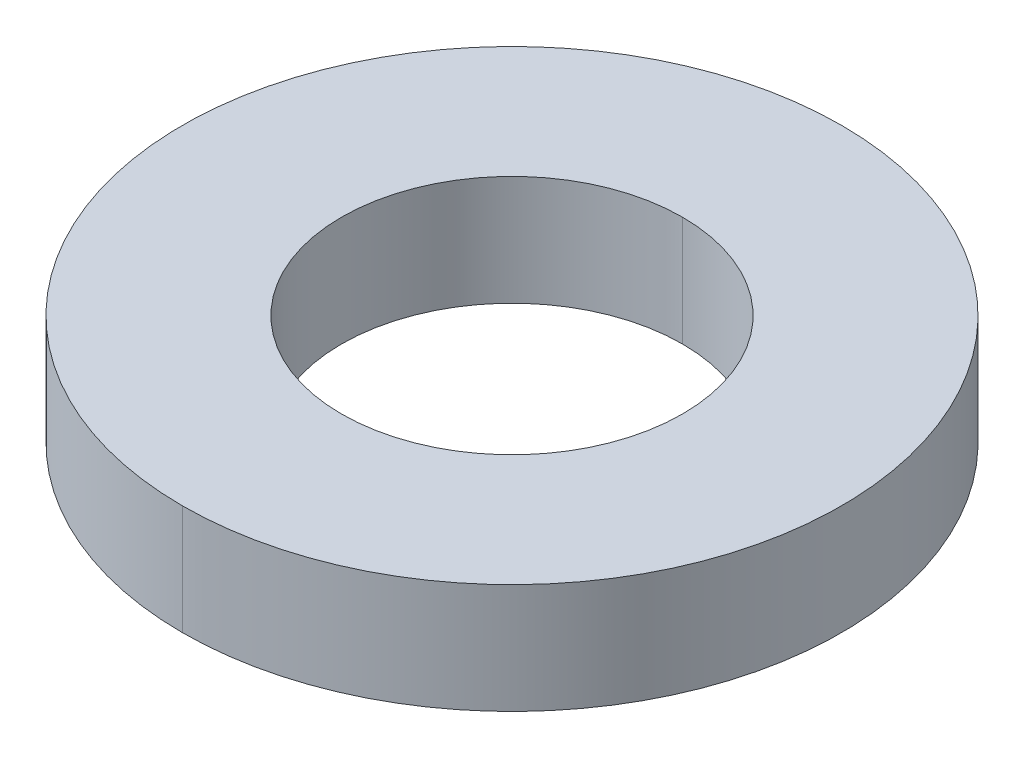
ISO-10303-21;
HEADER;
FILE_DESCRIPTION(('STEP AP214'),'2;1');
FILE_NAME('part.step','',(''),(''),'','','');
FILE_SCHEMA(('AUTOMOTIVE_DESIGN { 1 0 10303 214 1 1 1 1 }'));
ENDSEC;
DATA;
#1=APPLICATION_CONTEXT('core data for automotive mechanical design processes');
#2=APPLICATION_PROTOCOL_DEFINITION('international standard','automotive_design',2000,#1);
#3=PRODUCT_CONTEXT('',#1,'mechanical');
#4=PRODUCT('Part','Part','',(#3));
#5=PRODUCT_RELATED_PRODUCT_CATEGORY('part','',(#4));
#6=PRODUCT_DEFINITION_FORMATION('','',#4);
#7=PRODUCT_DEFINITION_CONTEXT('part definition',#1,'design');
#8=PRODUCT_DEFINITION('design','',#6,#7);
#9=PRODUCT_DEFINITION_SHAPE('','',#8);
#10=(LENGTH_UNIT() NAMED_UNIT(*) SI_UNIT(.MILLI.,.METRE.));
#11=(NAMED_UNIT(*) PLANE_ANGLE_UNIT() SI_UNIT($,.RADIAN.));
#12=(NAMED_UNIT(*) SI_UNIT($,.STERADIAN.) SOLID_ANGLE_UNIT());
#13=UNCERTAINTY_MEASURE_WITH_UNIT(LENGTH_MEASURE(1.E-05),#10,'distance_accuracy_value','');
#14=(GEOMETRIC_REPRESENTATION_CONTEXT(3) GLOBAL_UNCERTAINTY_ASSIGNED_CONTEXT((#13)) GLOBAL_UNIT_ASSIGNED_CONTEXT((#10,
#11,#12)) REPRESENTATION_CONTEXT('',''));
#15=CARTESIAN_POINT('',(0.,0.,0.));
#16=DIRECTION('',(0.,0.,1.));
#17=DIRECTION('',(1.,0.,0.));
#18=AXIS2_PLACEMENT_3D('',#15,#16,#17);
#19=CARTESIAN_POINT('',(0.,1.5875,0.));
#20=DIRECTION('',(0.,-1.,0.));
#21=DIRECTION('',(0.,0.,-1.));
#22=AXIS2_PLACEMENT_3D('',#19,#20,#21);
#23=CYLINDRICAL_SURFACE('',#22,2.4638);
#24=DIRECTION('',(0.,-1.,0.));
#25=VECTOR('',#24,1.);
#26=CARTESIAN_POINT('',(0.,1.5875,2.4638));
#27=LINE('',#26,#25);
#28=CARTESIAN_POINT('',(0.,1.5875,2.4638));
#29=VERTEX_POINT('',#28);
#30=CARTESIAN_POINT('',(0.,0.,2.4638));
#31=VERTEX_POINT('',#30);
#32=EDGE_CURVE('E77',#29,#31,#27,.T.);
#33=ORIENTED_EDGE('',*,*,#32,.F.);
#34=CARTESIAN_POINT('',(0.,1.5875,0.));
#35=DIRECTION('',(0.,1.,0.));
#36=DIRECTION('',(0.,0.,1.));
#37=AXIS2_PLACEMENT_3D('',#34,#35,#36);
#38=CIRCLE('',#37,2.4638);
#39=CARTESIAN_POINT('',(0.,1.5875,-2.4638));
#40=VERTEX_POINT('',#39);
#41=EDGE_CURVE('E20',#29,#40,#38,.T.);
#42=ORIENTED_EDGE('',*,*,#41,.T.);
#43=DIRECTION('',(0.,-1.,0.));
#44=VECTOR('',#43,1.);
#45=CARTESIAN_POINT('',(0.,1.5875,-2.4638));
#46=LINE('',#45,#44);
#47=CARTESIAN_POINT('',(0.,0.,-2.4638));
#48=VERTEX_POINT('',#47);
#49=EDGE_CURVE('E74',#40,#48,#46,.T.);
#50=ORIENTED_EDGE('',*,*,#49,.T.);
#51=CARTESIAN_POINT('',(0.,0.,0.));
#52=DIRECTION('',(0.,1.,0.));
#53=DIRECTION('',(0.,0.,1.));
#54=AXIS2_PLACEMENT_3D('',#51,#52,#53);
#55=CIRCLE('',#54,2.4638);
#56=EDGE_CURVE('E11',#31,#48,#55,.T.);
#57=ORIENTED_EDGE('',*,*,#56,.F.);
#58=EDGE_LOOP('',(#33,#42,#50,#57));
#59=FACE_BOUND('',#58,.T.);
#60=ADVANCED_FACE('F17',(#59),#23,.F.);
#61=CARTESIAN_POINT('',(0.,1.5875,0.));
#62=DIRECTION('',(0.,-1.,0.));
#63=DIRECTION('',(0.,0.,-1.));
#64=AXIS2_PLACEMENT_3D('',#61,#62,#63);
#65=CYLINDRICAL_SURFACE('',#64,4.7625);
#66=DIRECTION('',(0.,-1.,0.));
#67=VECTOR('',#66,1.);
#68=CARTESIAN_POINT('',(0.,1.5875,4.7625));
#69=LINE('',#68,#67);
#70=CARTESIAN_POINT('',(0.,1.5875,4.7625));
#71=VERTEX_POINT('',#70);
#72=CARTESIAN_POINT('',(0.,0.,4.7625));
#73=VERTEX_POINT('',#72);
#74=EDGE_CURVE('E111',#71,#73,#69,.T.);
#75=ORIENTED_EDGE('',*,*,#74,.F.);
#76=CARTESIAN_POINT('',(0.,1.5875,0.));
#77=DIRECTION('',(0.,1.,0.));
#78=DIRECTION('',(0.,0.,1.));
#79=AXIS2_PLACEMENT_3D('',#76,#77,#78);
#80=CIRCLE('',#79,4.7625);
#81=CARTESIAN_POINT('',(0.,1.5875,-4.7625));
#82=VERTEX_POINT('',#81);
#83=EDGE_CURVE('E82',#82,#71,#80,.T.);
#84=ORIENTED_EDGE('',*,*,#83,.F.);
#85=DIRECTION('',(0.,-1.,0.));
#86=VECTOR('',#85,1.);
#87=CARTESIAN_POINT('',(0.,1.5875,-4.7625));
#88=LINE('',#87,#86);
#89=CARTESIAN_POINT('',(0.,0.,-4.7625));
#90=VERTEX_POINT('',#89);
#91=EDGE_CURVE('E106',#82,#90,#88,.T.);
#92=ORIENTED_EDGE('',*,*,#91,.T.);
#93=CARTESIAN_POINT('',(0.,0.,0.));
#94=DIRECTION('',(0.,1.,0.));
#95=DIRECTION('',(0.,0.,1.));
#96=AXIS2_PLACEMENT_3D('',#93,#94,#95);
#97=CIRCLE('',#96,4.7625);
#98=EDGE_CURVE('E26',#90,#73,#97,.T.);
#99=ORIENTED_EDGE('',*,*,#98,.T.);
#100=EDGE_LOOP('',(#75,#84,#92,#99));
#101=FACE_BOUND('',#100,.T.);
#102=ADVANCED_FACE('F122',(#101),#65,.T.);
#103=CARTESIAN_POINT('',(0.,0.,0.));
#104=DIRECTION('',(0.,1.,0.));
#105=DIRECTION('',(1.,0.,0.));
#106=AXIS2_PLACEMENT_3D('',#103,#104,#105);
#107=PLANE('',#106);
#108=CARTESIAN_POINT('',(0.,0.,0.));
#109=DIRECTION('',(0.,1.,0.));
#110=DIRECTION('',(0.,0.,1.));
#111=AXIS2_PLACEMENT_3D('',#108,#109,#110);
#112=CIRCLE('',#111,2.4638);
#113=EDGE_CURVE('E87',#48,#31,#112,.T.);
#114=ORIENTED_EDGE('',*,*,#113,.T.);
#115=ORIENTED_EDGE('',*,*,#56,.T.);
#116=EDGE_LOOP('',(#114,#115));
#117=FACE_BOUND('',#116,.T.);
#118=ORIENTED_EDGE('',*,*,#98,.F.);
#119=CARTESIAN_POINT('',(0.,0.,0.));
#120=DIRECTION('',(0.,1.,0.));
#121=DIRECTION('',(0.,0.,1.));
#122=AXIS2_PLACEMENT_3D('',#119,#120,#121);
#123=CIRCLE('',#122,4.7625);
#124=EDGE_CURVE('E114',#73,#90,#123,.T.);
#125=ORIENTED_EDGE('',*,*,#124,.F.);
#126=EDGE_LOOP('',(#118,#125));
#127=FACE_BOUND('',#126,.T.);
#128=ADVANCED_FACE('F126',(#117,#127),#107,.F.);
#129=CARTESIAN_POINT('',(0.,1.5875,0.));
#130=DIRECTION('',(0.,1.,0.));
#131=DIRECTION('',(1.,0.,0.));
#132=AXIS2_PLACEMENT_3D('',#129,#130,#131);
#133=PLANE('',#132);
#134=CARTESIAN_POINT('',(0.,1.5875,0.));
#135=DIRECTION('',(0.,1.,0.));
#136=DIRECTION('',(0.,0.,1.));
#137=AXIS2_PLACEMENT_3D('',#134,#135,#136);
#138=CIRCLE('',#137,2.4638);
#139=EDGE_CURVE('E85',#40,#29,#138,.T.);
#140=ORIENTED_EDGE('',*,*,#139,.F.);
#141=ORIENTED_EDGE('',*,*,#41,.F.);
#142=EDGE_LOOP('',(#140,#141));
#143=FACE_BOUND('',#142,.T.);
#144=ORIENTED_EDGE('',*,*,#83,.T.);
#145=CARTESIAN_POINT('',(0.,1.5875,0.));
#146=DIRECTION('',(0.,1.,0.));
#147=DIRECTION('',(0.,0.,1.));
#148=AXIS2_PLACEMENT_3D('',#145,#146,#147);
#149=CIRCLE('',#148,4.7625);
#150=EDGE_CURVE('E89',#71,#82,#149,.T.);
#151=ORIENTED_EDGE('',*,*,#150,.T.);
#152=EDGE_LOOP('',(#144,#151));
#153=FACE_BOUND('',#152,.T.);
#154=ADVANCED_FACE('F91',(#143,#153),#133,.T.);
#155=CARTESIAN_POINT('',(0.,1.5875,0.));
#156=DIRECTION('',(0.,-1.,0.));
#157=DIRECTION('',(0.,0.,-1.));
#158=AXIS2_PLACEMENT_3D('',#155,#156,#157);
#159=CYLINDRICAL_SURFACE('',#158,4.7625);
#160=ORIENTED_EDGE('',*,*,#150,.F.);
#161=ORIENTED_EDGE('',*,*,#74,.T.);
#162=ORIENTED_EDGE('',*,*,#124,.T.);
#163=ORIENTED_EDGE('',*,*,#91,.F.);
#164=EDGE_LOOP('',(#160,#161,#162,#163));
#165=FACE_BOUND('',#164,.T.);
#166=ADVANCED_FACE('F125',(#165),#159,.T.);
#167=CARTESIAN_POINT('',(0.,1.5875,0.));
#168=DIRECTION('',(0.,-1.,0.));
#169=DIRECTION('',(0.,0.,-1.));
#170=AXIS2_PLACEMENT_3D('',#167,#168,#169);
#171=CYLINDRICAL_SURFACE('',#170,2.4638);
#172=ORIENTED_EDGE('',*,*,#139,.T.);
#173=ORIENTED_EDGE('',*,*,#32,.T.);
#174=ORIENTED_EDGE('',*,*,#113,.F.);
#175=ORIENTED_EDGE('',*,*,#49,.F.);
#176=EDGE_LOOP('',(#172,#173,#174,#175));
#177=FACE_BOUND('',#176,.T.);
#178=ADVANCED_FACE('F84',(#177),#171,.F.);
#179=CLOSED_SHELL('',(#60,#102,#128,#154,#166,#178));
#180=MANIFOLD_SOLID_BREP('B1',#179);
#181=ADVANCED_BREP_SHAPE_REPRESENTATION('',(#18,#180),#14);
#182=SHAPE_DEFINITION_REPRESENTATION(#9,#181);
ENDSEC;
END-ISO-10303-21;
